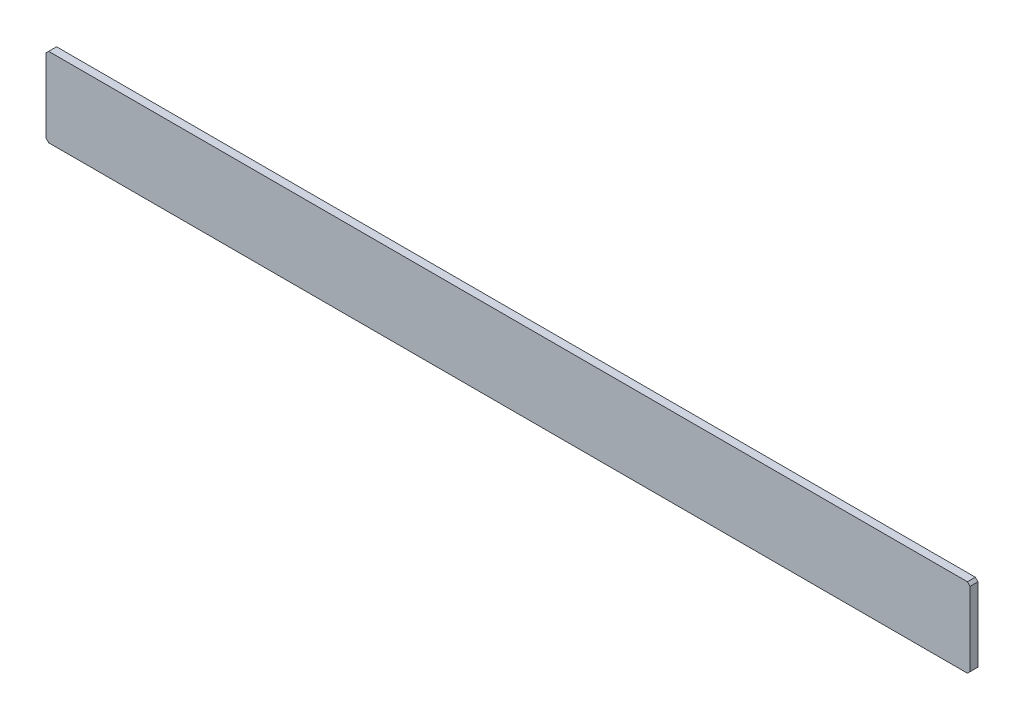
ISO-10303-21;
HEADER;
FILE_DESCRIPTION(('STEP AP214'),'2;1');
FILE_NAME('part.step','',(''),(''),'','','');
FILE_SCHEMA(('AUTOMOTIVE_DESIGN { 1 0 10303 214 1 1 1 1 }'));
ENDSEC;
DATA;
#1=APPLICATION_CONTEXT('core data for automotive mechanical design processes');
#2=APPLICATION_PROTOCOL_DEFINITION('international standard','automotive_design',2000,#1);
#3=PRODUCT_CONTEXT('',#1,'mechanical');
#4=PRODUCT('Part','Part','',(#3));
#5=PRODUCT_RELATED_PRODUCT_CATEGORY('part','',(#4));
#6=PRODUCT_DEFINITION_FORMATION('','',#4);
#7=PRODUCT_DEFINITION_CONTEXT('part definition',#1,'design');
#8=PRODUCT_DEFINITION('design','',#6,#7);
#9=PRODUCT_DEFINITION_SHAPE('','',#8);
#10=(LENGTH_UNIT() NAMED_UNIT(*) SI_UNIT(.MILLI.,.METRE.));
#11=(NAMED_UNIT(*) PLANE_ANGLE_UNIT() SI_UNIT($,.RADIAN.));
#12=(NAMED_UNIT(*) SI_UNIT($,.STERADIAN.) SOLID_ANGLE_UNIT());
#13=UNCERTAINTY_MEASURE_WITH_UNIT(LENGTH_MEASURE(1.E-05),#10,'distance_accuracy_value','');
#14=(GEOMETRIC_REPRESENTATION_CONTEXT(3) GLOBAL_UNCERTAINTY_ASSIGNED_CONTEXT((#13)) GLOBAL_UNIT_ASSIGNED_CONTEXT((#10,
#11,#12)) REPRESENTATION_CONTEXT('',''));
#15=CARTESIAN_POINT('',(0.,0.,0.));
#16=DIRECTION('',(0.,0.,1.));
#17=DIRECTION('',(1.,0.,0.));
#18=AXIS2_PLACEMENT_3D('',#15,#16,#17);
#19=CARTESIAN_POINT('',(-350.,-30.,3.));
#20=DIRECTION('',(1.,0.,0.));
#21=DIRECTION('',(0.,0.,-1.));
#22=AXIS2_PLACEMENT_3D('',#19,#20,#21);
#23=PLANE('',#22);
#24=DIRECTION('',(0.,-1.,0.));
#25=VECTOR('',#24,1.);
#26=CARTESIAN_POINT('',(-350.,-30.,-3.));
#27=LINE('',#26,#25);
#28=CARTESIAN_POINT('',(-350.,28.,-3.));
#29=VERTEX_POINT('',#28);
#30=CARTESIAN_POINT('',(-350.,-28.,-3.));
#31=VERTEX_POINT('',#30);
#32=EDGE_CURVE('E130',#29,#31,#27,.T.);
#33=ORIENTED_EDGE('',*,*,#32,.T.);
#34=DIRECTION('',(0.,0.,1.));
#35=VECTOR('',#34,1.);
#36=CARTESIAN_POINT('',(-350.,-28.,3.));
#37=LINE('',#36,#35);
#38=CARTESIAN_POINT('',(-350.,-28.,3.));
#39=VERTEX_POINT('',#38);
#40=EDGE_CURVE('E11',#31,#39,#37,.T.);
#41=ORIENTED_EDGE('',*,*,#40,.T.);
#42=DIRECTION('',(0.,-1.,0.));
#43=VECTOR('',#42,1.);
#44=CARTESIAN_POINT('',(-350.,-30.,3.));
#45=LINE('',#44,#43);
#46=CARTESIAN_POINT('',(-350.,28.,3.));
#47=VERTEX_POINT('',#46);
#48=EDGE_CURVE('E128',#47,#39,#45,.T.);
#49=ORIENTED_EDGE('',*,*,#48,.F.);
#50=DIRECTION('',(0.,0.,-1.));
#51=VECTOR('',#50,1.);
#52=CARTESIAN_POINT('',(-350.,28.,3.));
#53=LINE('',#52,#51);
#54=EDGE_CURVE('E42',#47,#29,#53,.T.);
#55=ORIENTED_EDGE('',*,*,#54,.T.);
#56=EDGE_LOOP('',(#33,#41,#49,#55));
#57=FACE_BOUND('',#56,.T.);
#58=ADVANCED_FACE('F34',(#57),#23,.F.);
#59=CARTESIAN_POINT('',(350.,-30.,3.));
#60=DIRECTION('',(0.,1.,0.));
#61=DIRECTION('',(-1.,0.,0.));
#62=AXIS2_PLACEMENT_3D('',#59,#60,#61);
#63=PLANE('',#62);
#64=DIRECTION('',(1.,0.,0.));
#65=VECTOR('',#64,1.);
#66=CARTESIAN_POINT('',(350.,-30.,-3.));
#67=LINE('',#66,#65);
#68=CARTESIAN_POINT('',(-348.,-30.,-3.));
#69=VERTEX_POINT('',#68);
#70=CARTESIAN_POINT('',(348.,-30.,-3.));
#71=VERTEX_POINT('',#70);
#72=EDGE_CURVE('E126',#69,#71,#67,.T.);
#73=ORIENTED_EDGE('',*,*,#72,.T.);
#74=DIRECTION('',(0.,0.,1.));
#75=VECTOR('',#74,1.);
#76=CARTESIAN_POINT('',(348.,-30.,3.));
#77=LINE('',#76,#75);
#78=CARTESIAN_POINT('',(348.,-29.9999999999999,3.));
#79=VERTEX_POINT('',#78);
#80=EDGE_CURVE('E105',#71,#79,#77,.T.);
#81=ORIENTED_EDGE('',*,*,#80,.T.);
#82=DIRECTION('',(1.,0.,0.));
#83=VECTOR('',#82,1.);
#84=CARTESIAN_POINT('',(350.,-30.,3.));
#85=LINE('',#84,#83);
#86=CARTESIAN_POINT('',(-348.,-30.0000000000001,3.));
#87=VERTEX_POINT('',#86);
#88=EDGE_CURVE('E166',#87,#79,#85,.T.);
#89=ORIENTED_EDGE('',*,*,#88,.F.);
#90=DIRECTION('',(0.,0.,-1.));
#91=VECTOR('',#90,1.);
#92=CARTESIAN_POINT('',(-348.,-30.,3.));
#93=LINE('',#92,#91);
#94=EDGE_CURVE('E110',#87,#69,#93,.T.);
#95=ORIENTED_EDGE('',*,*,#94,.T.);
#96=EDGE_LOOP('',(#73,#81,#89,#95));
#97=FACE_BOUND('',#96,.T.);
#98=ADVANCED_FACE('F176',(#97),#63,.F.);
#99=CARTESIAN_POINT('',(350.,-30.,3.));
#100=DIRECTION('',(-1.,0.,0.));
#101=DIRECTION('',(0.,0.,1.));
#102=AXIS2_PLACEMENT_3D('',#99,#100,#101);
#103=PLANE('',#102);
#104=DIRECTION('',(0.,1.,0.));
#105=VECTOR('',#104,1.);
#106=CARTESIAN_POINT('',(350.,-30.,3.));
#107=LINE('',#106,#105);
#108=CARTESIAN_POINT('',(350.,-27.9999999999999,3.));
#109=VERTEX_POINT('',#108);
#110=CARTESIAN_POINT('',(350.,28.0000000000002,3.));
#111=VERTEX_POINT('',#110);
#112=EDGE_CURVE('E119',#109,#111,#107,.T.);
#113=ORIENTED_EDGE('',*,*,#112,.F.);
#114=DIRECTION('',(0.,0.,-1.));
#115=VECTOR('',#114,1.);
#116=CARTESIAN_POINT('',(350.,-28.,3.));
#117=LINE('',#116,#115);
#118=CARTESIAN_POINT('',(350.,-28.,-3.));
#119=VERTEX_POINT('',#118);
#120=EDGE_CURVE('E104',#109,#119,#117,.T.);
#121=ORIENTED_EDGE('',*,*,#120,.T.);
#122=DIRECTION('',(0.,1.,0.));
#123=VECTOR('',#122,1.);
#124=CARTESIAN_POINT('',(350.,-30.,-3.));
#125=LINE('',#124,#123);
#126=CARTESIAN_POINT('',(350.,28.0000000000001,-3.));
#127=VERTEX_POINT('',#126);
#128=EDGE_CURVE('E117',#119,#127,#125,.T.);
#129=ORIENTED_EDGE('',*,*,#128,.T.);
#130=DIRECTION('',(0.,0.,1.));
#131=VECTOR('',#130,1.);
#132=CARTESIAN_POINT('',(350.,28.0000000000001,3.));
#133=LINE('',#132,#131);
#134=EDGE_CURVE('E121',#127,#111,#133,.T.);
#135=ORIENTED_EDGE('',*,*,#134,.T.);
#136=EDGE_LOOP('',(#113,#121,#129,#135));
#137=FACE_BOUND('',#136,.T.);
#138=ADVANCED_FACE('F116',(#137),#103,.F.);
#139=CARTESIAN_POINT('',(350.,30.,3.));
#140=DIRECTION('',(0.,-1.,0.));
#141=DIRECTION('',(1.,0.,0.));
#142=AXIS2_PLACEMENT_3D('',#139,#140,#141);
#143=PLANE('',#142);
#144=DIRECTION('',(-1.,0.,0.));
#145=VECTOR('',#144,1.);
#146=CARTESIAN_POINT('',(350.,30.,3.));
#147=LINE('',#146,#145);
#148=CARTESIAN_POINT('',(348.,30.,3.));
#149=VERTEX_POINT('',#148);
#150=CARTESIAN_POINT('',(-348.,29.9999999999999,3.));
#151=VERTEX_POINT('',#150);
#152=EDGE_CURVE('E134',#149,#151,#147,.T.);
#153=ORIENTED_EDGE('',*,*,#152,.F.);
#154=DIRECTION('',(0.,0.,-1.));
#155=VECTOR('',#154,1.);
#156=CARTESIAN_POINT('',(348.,30.,3.));
#157=LINE('',#156,#155);
#158=CARTESIAN_POINT('',(348.,30.,-3.));
#159=VERTEX_POINT('',#158);
#160=EDGE_CURVE('E151',#149,#159,#157,.T.);
#161=ORIENTED_EDGE('',*,*,#160,.T.);
#162=DIRECTION('',(-1.,0.,0.));
#163=VECTOR('',#162,1.);
#164=CARTESIAN_POINT('',(350.,30.,-3.));
#165=LINE('',#164,#163);
#166=CARTESIAN_POINT('',(-348.,30.,-3.));
#167=VERTEX_POINT('',#166);
#168=EDGE_CURVE('E125',#159,#167,#165,.T.);
#169=ORIENTED_EDGE('',*,*,#168,.T.);
#170=DIRECTION('',(0.,0.,1.));
#171=VECTOR('',#170,1.);
#172=CARTESIAN_POINT('',(-348.,30.,3.));
#173=LINE('',#172,#171);
#174=EDGE_CURVE('E49',#167,#151,#173,.T.);
#175=ORIENTED_EDGE('',*,*,#174,.T.);
#176=EDGE_LOOP('',(#153,#161,#169,#175));
#177=FACE_BOUND('',#176,.T.);
#178=ADVANCED_FACE('F180',(#177),#143,.F.);
#179=CARTESIAN_POINT('',(0.,0.,3.));
#180=DIRECTION('',(0.,0.,1.));
#181=DIRECTION('',(1.,0.,0.));
#182=AXIS2_PLACEMENT_3D('',#179,#180,#181);
#183=PLANE('',#182);
#184=ORIENTED_EDGE('',*,*,#88,.T.);
#185=DIRECTION('',(-0.707106781186548,-0.707106781186548,0.));
#186=VECTOR('',#185,1.);
#187=CARTESIAN_POINT('',(189.,-189.,3.));
#188=LINE('',#187,#186);
#189=EDGE_CURVE('E148',#79,#109,#188,.F.);
#190=ORIENTED_EDGE('',*,*,#189,.T.);
#191=ORIENTED_EDGE('',*,*,#112,.T.);
#192=DIRECTION('',(0.707106781186547,-0.707106781186548,0.));
#193=VECTOR('',#192,1.);
#194=CARTESIAN_POINT('',(189.,189.,3.));
#195=LINE('',#194,#193);
#196=EDGE_CURVE('E56',#111,#149,#195,.F.);
#197=ORIENTED_EDGE('',*,*,#196,.T.);
#198=ORIENTED_EDGE('',*,*,#152,.T.);
#199=DIRECTION('',(0.707106781186547,0.707106781186548,0.));
#200=VECTOR('',#199,1.);
#201=CARTESIAN_POINT('',(-189.,189.,3.));
#202=LINE('',#201,#200);
#203=EDGE_CURVE('E143',#151,#47,#202,.F.);
#204=ORIENTED_EDGE('',*,*,#203,.T.);
#205=ORIENTED_EDGE('',*,*,#48,.T.);
#206=DIRECTION('',(-0.707106781186538,0.707106781186557,0.));
#207=VECTOR('',#206,1.);
#208=CARTESIAN_POINT('',(-189.000000000005,-189.,3.));
#209=LINE('',#208,#207);
#210=EDGE_CURVE('E145',#39,#87,#209,.F.);
#211=ORIENTED_EDGE('',*,*,#210,.T.);
#212=EDGE_LOOP('',(#184,#190,#191,#197,#198,#204,#205,#211));
#213=FACE_BOUND('',#212,.T.);
#214=ADVANCED_FACE('F170',(#213),#183,.T.);
#215=CARTESIAN_POINT('',(0.,0.,-3.));
#216=DIRECTION('',(0.,0.,1.));
#217=DIRECTION('',(1.,0.,0.));
#218=AXIS2_PLACEMENT_3D('',#215,#216,#217);
#219=PLANE('',#218);
#220=ORIENTED_EDGE('',*,*,#128,.F.);
#221=DIRECTION('',(0.707106781186548,0.707106781186548,0.));
#222=VECTOR('',#221,1.);
#223=CARTESIAN_POINT('',(350.,-28.,-3.));
#224=LINE('',#223,#222);
#225=EDGE_CURVE('E100',#119,#71,#224,.F.);
#226=ORIENTED_EDGE('',*,*,#225,.T.);
#227=ORIENTED_EDGE('',*,*,#72,.F.);
#228=DIRECTION('',(0.707106781186538,-0.707106781186557,0.));
#229=VECTOR('',#228,1.);
#230=CARTESIAN_POINT('',(-348.,-30.,-3.));
#231=LINE('',#230,#229);
#232=EDGE_CURVE('E137',#69,#31,#231,.F.);
#233=ORIENTED_EDGE('',*,*,#232,.T.);
#234=ORIENTED_EDGE('',*,*,#32,.F.);
#235=DIRECTION('',(-0.707106781186547,-0.707106781186548,0.));
#236=VECTOR('',#235,1.);
#237=CARTESIAN_POINT('',(-350.,28.,-3.));
#238=LINE('',#237,#236);
#239=EDGE_CURVE('E120',#29,#167,#238,.F.);
#240=ORIENTED_EDGE('',*,*,#239,.T.);
#241=ORIENTED_EDGE('',*,*,#168,.F.);
#242=DIRECTION('',(-0.707106781186547,0.707106781186548,0.));
#243=VECTOR('',#242,1.);
#244=CARTESIAN_POINT('',(348.,30.,-3.));
#245=LINE('',#244,#243);
#246=EDGE_CURVE('E111',#159,#127,#245,.F.);
#247=ORIENTED_EDGE('',*,*,#246,.T.);
#248=EDGE_LOOP('',(#220,#226,#227,#233,#234,#240,#241,#247));
#249=FACE_BOUND('',#248,.T.);
#250=ADVANCED_FACE('F123',(#249),#219,.F.);
#251=CARTESIAN_POINT('',(350.,-28.,3.));
#252=DIRECTION('',(-0.707106781186547,0.707106781186547,0.));
#253=DIRECTION('',(0.,0.,-1.));
#254=AXIS2_PLACEMENT_3D('',#251,#252,#253);
#255=PLANE('',#254);
#256=ORIENTED_EDGE('',*,*,#189,.F.);
#257=ORIENTED_EDGE('',*,*,#80,.F.);
#258=ORIENTED_EDGE('',*,*,#225,.F.);
#259=ORIENTED_EDGE('',*,*,#120,.F.);
#260=EDGE_LOOP('',(#256,#257,#258,#259));
#261=FACE_BOUND('',#260,.T.);
#262=ADVANCED_FACE('F103',(#261),#255,.F.);
#263=CARTESIAN_POINT('',(348.,30.,3.));
#264=DIRECTION('',(-0.707106781186548,-0.707106781186547,0.));
#265=DIRECTION('',(0.,0.,-1.));
#266=AXIS2_PLACEMENT_3D('',#263,#264,#265);
#267=PLANE('',#266);
#268=ORIENTED_EDGE('',*,*,#196,.F.);
#269=ORIENTED_EDGE('',*,*,#134,.F.);
#270=ORIENTED_EDGE('',*,*,#246,.F.);
#271=ORIENTED_EDGE('',*,*,#160,.F.);
#272=EDGE_LOOP('',(#268,#269,#270,#271));
#273=FACE_BOUND('',#272,.T.);
#274=ADVANCED_FACE('F179',(#273),#267,.F.);
#275=CARTESIAN_POINT('',(-348.,-30.,3.));
#276=DIRECTION('',(0.707106781186557,0.707106781186538,0.));
#277=DIRECTION('',(0.,0.,-1.));
#278=AXIS2_PLACEMENT_3D('',#275,#276,#277);
#279=PLANE('',#278);
#280=ORIENTED_EDGE('',*,*,#210,.F.);
#281=ORIENTED_EDGE('',*,*,#40,.F.);
#282=ORIENTED_EDGE('',*,*,#232,.F.);
#283=ORIENTED_EDGE('',*,*,#94,.F.);
#284=EDGE_LOOP('',(#280,#281,#282,#283));
#285=FACE_BOUND('',#284,.T.);
#286=ADVANCED_FACE('F174',(#285),#279,.F.);
#287=CARTESIAN_POINT('',(-350.,28.,3.));
#288=DIRECTION('',(0.707106781186548,-0.707106781186547,0.));
#289=DIRECTION('',(0.,0.,-1.));
#290=AXIS2_PLACEMENT_3D('',#287,#288,#289);
#291=PLANE('',#290);
#292=ORIENTED_EDGE('',*,*,#203,.F.);
#293=ORIENTED_EDGE('',*,*,#174,.F.);
#294=ORIENTED_EDGE('',*,*,#239,.F.);
#295=ORIENTED_EDGE('',*,*,#54,.F.);
#296=EDGE_LOOP('',(#292,#293,#294,#295));
#297=FACE_BOUND('',#296,.T.);
#298=ADVANCED_FACE('F36',(#297),#291,.F.);
#299=CLOSED_SHELL('',(#58,#98,#138,#178,#214,#250,#262,#274,#286,#298));
#300=MANIFOLD_SOLID_BREP('B2',#299);
#301=ADVANCED_BREP_SHAPE_REPRESENTATION('',(#18,#300),#14);
#302=SHAPE_DEFINITION_REPRESENTATION(#9,#301);
ENDSEC;
END-ISO-10303-21;
